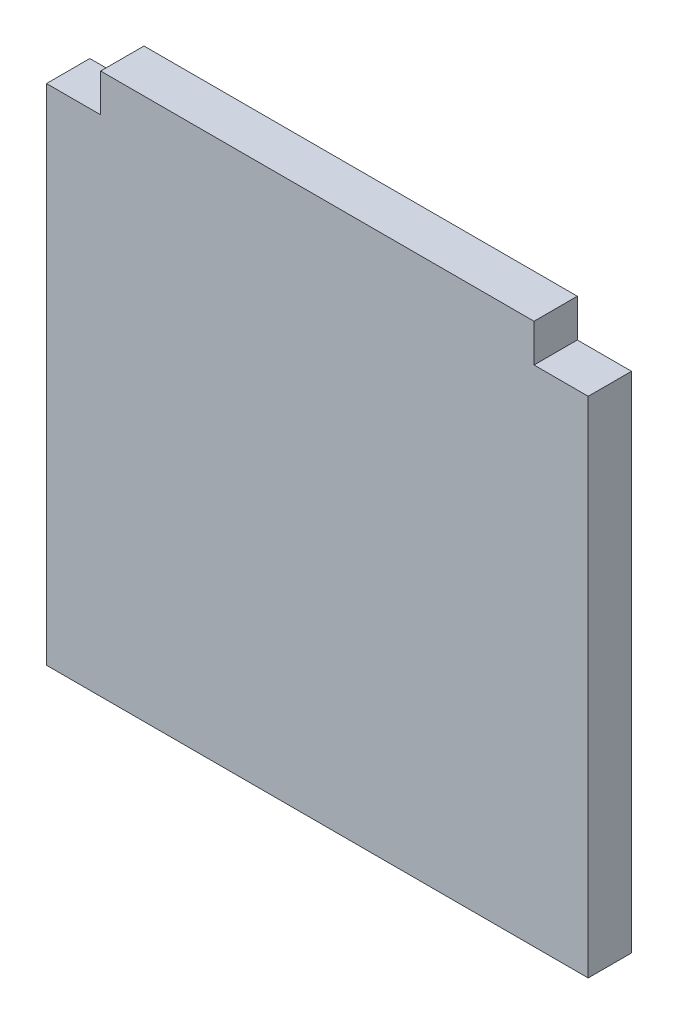
ISO-10303-21;
HEADER;
FILE_DESCRIPTION(('STEP AP214'),'2;1');
FILE_NAME('part.step','',(''),(''),'','','');
FILE_SCHEMA(('AUTOMOTIVE_DESIGN { 1 0 10303 214 1 1 1 1 }'));
ENDSEC;
DATA;
#1=APPLICATION_CONTEXT('core data for automotive mechanical design processes');
#2=APPLICATION_PROTOCOL_DEFINITION('international standard','automotive_design',2000,#1);
#3=PRODUCT_CONTEXT('',#1,'mechanical');
#4=PRODUCT('Part','Part','',(#3));
#5=PRODUCT_RELATED_PRODUCT_CATEGORY('part','',(#4));
#6=PRODUCT_DEFINITION_FORMATION('','',#4);
#7=PRODUCT_DEFINITION_CONTEXT('part definition',#1,'design');
#8=PRODUCT_DEFINITION('design','',#6,#7);
#9=PRODUCT_DEFINITION_SHAPE('','',#8);
#10=(LENGTH_UNIT() NAMED_UNIT(*) SI_UNIT(.MILLI.,.METRE.));
#11=(NAMED_UNIT(*) PLANE_ANGLE_UNIT() SI_UNIT($,.RADIAN.));
#12=(NAMED_UNIT(*) SI_UNIT($,.STERADIAN.) SOLID_ANGLE_UNIT());
#13=UNCERTAINTY_MEASURE_WITH_UNIT(LENGTH_MEASURE(1.E-05),#10,'distance_accuracy_value','');
#14=(GEOMETRIC_REPRESENTATION_CONTEXT(3) GLOBAL_UNCERTAINTY_ASSIGNED_CONTEXT((#13)) GLOBAL_UNIT_ASSIGNED_CONTEXT((#10,
#11,#12)) REPRESENTATION_CONTEXT('',''));
#15=CARTESIAN_POINT('',(0.,0.,0.));
#16=DIRECTION('',(0.,0.,1.));
#17=DIRECTION('',(1.,0.,0.));
#18=AXIS2_PLACEMENT_3D('',#15,#16,#17);
#19=CARTESIAN_POINT('',(0.4,0.,0.));
#20=DIRECTION('',(-1.,0.,0.));
#21=DIRECTION('',(0.,-1.,0.));
#22=AXIS2_PLACEMENT_3D('',#19,#20,#21);
#23=PLANE('',#22);
#24=DIRECTION('',(0.,-1.,0.));
#25=VECTOR('',#24,1.);
#26=CARTESIAN_POINT('',(0.4,0.,0.08));
#27=LINE('',#26,#25);
#28=CARTESIAN_POINT('',(0.4,-0.866025403784439,0.08));
#29=VERTEX_POINT('',#28);
#30=CARTESIAN_POINT('',(0.4,-0.936025403784438,0.08));
#31=VERTEX_POINT('',#30);
#32=EDGE_CURVE('E132',#29,#31,#27,.T.);
#33=ORIENTED_EDGE('',*,*,#32,.T.);
#34=DIRECTION('',(0.,0.,1.));
#35=VECTOR('',#34,1.);
#36=CARTESIAN_POINT('',(0.4,-0.936025403784438,0.));
#37=LINE('',#36,#35);
#38=CARTESIAN_POINT('',(0.4,-0.936025403784438,0.));
#39=VERTEX_POINT('',#38);
#40=EDGE_CURVE('E11',#39,#31,#37,.T.);
#41=ORIENTED_EDGE('',*,*,#40,.F.);
#42=DIRECTION('',(0.,-1.,0.));
#43=VECTOR('',#42,1.);
#44=CARTESIAN_POINT('',(0.4,0.,0.));
#45=LINE('',#44,#43);
#46=CARTESIAN_POINT('',(0.4,-0.866025403784439,0.));
#47=VERTEX_POINT('',#46);
#48=EDGE_CURVE('E53',#47,#39,#45,.T.);
#49=ORIENTED_EDGE('',*,*,#48,.F.);
#50=DIRECTION('',(0.,0.,1.));
#51=VECTOR('',#50,1.);
#52=CARTESIAN_POINT('',(0.4,-0.866025403784439,0.));
#53=LINE('',#52,#51);
#54=EDGE_CURVE('E38',#47,#29,#53,.T.);
#55=ORIENTED_EDGE('',*,*,#54,.T.);
#56=EDGE_LOOP('',(#33,#41,#49,#55));
#57=FACE_BOUND('',#56,.T.);
#58=ADVANCED_FACE('F35',(#57),#23,.F.);
#59=CARTESIAN_POINT('',(0.,-0.936025403784438,0.));
#60=DIRECTION('',(0.,1.,0.));
#61=DIRECTION('',(-1.,0.,0.));
#62=AXIS2_PLACEMENT_3D('',#59,#60,#61);
#63=PLANE('',#62);
#64=DIRECTION('',(-1.,0.,0.));
#65=VECTOR('',#64,1.);
#66=CARTESIAN_POINT('',(0.,-0.936025403784438,0.08));
#67=LINE('',#66,#65);
#68=CARTESIAN_POINT('',(0.5,-0.936025403784438,0.08));
#69=VERTEX_POINT('',#68);
#70=EDGE_CURVE('E148',#69,#31,#67,.T.);
#71=ORIENTED_EDGE('',*,*,#70,.F.);
#72=DIRECTION('',(0.,0.,1.));
#73=VECTOR('',#72,1.);
#74=CARTESIAN_POINT('',(0.5,-0.936025403784438,0.));
#75=LINE('',#74,#73);
#76=CARTESIAN_POINT('',(0.5,-0.936025403784438,0.));
#77=VERTEX_POINT('',#76);
#78=EDGE_CURVE('E44',#77,#69,#75,.T.);
#79=ORIENTED_EDGE('',*,*,#78,.F.);
#80=DIRECTION('',(-1.,0.,0.));
#81=VECTOR('',#80,1.);
#82=CARTESIAN_POINT('',(0.,-0.936025403784438,0.));
#83=LINE('',#82,#81);
#84=EDGE_CURVE('E112',#77,#39,#83,.T.);
#85=ORIENTED_EDGE('',*,*,#84,.T.);
#86=ORIENTED_EDGE('',*,*,#40,.T.);
#87=EDGE_LOOP('',(#71,#79,#85,#86));
#88=FACE_BOUND('',#87,.T.);
#89=ADVANCED_FACE('F165',(#88),#63,.T.);
#90=CARTESIAN_POINT('',(0.5,0.,0.));
#91=DIRECTION('',(-1.,0.,0.));
#92=DIRECTION('',(0.,-1.,0.));
#93=AXIS2_PLACEMENT_3D('',#90,#91,#92);
#94=PLANE('',#93);
#95=DIRECTION('',(0.,-1.,0.));
#96=VECTOR('',#95,1.);
#97=CARTESIAN_POINT('',(0.5,0.,0.08));
#98=LINE('',#97,#96);
#99=CARTESIAN_POINT('',(0.500000000000001,-1.86602540378444,0.08));
#100=VERTEX_POINT('',#99);
#101=EDGE_CURVE('E117',#69,#100,#98,.T.);
#102=ORIENTED_EDGE('',*,*,#101,.T.);
#103=DIRECTION('',(0.,0.,1.));
#104=VECTOR('',#103,1.);
#105=CARTESIAN_POINT('',(0.500000000000001,-1.86602540378444,0.));
#106=LINE('',#105,#104);
#107=CARTESIAN_POINT('',(0.500000000000001,-1.86602540378444,0.));
#108=VERTEX_POINT('',#107);
#109=EDGE_CURVE('E115',#108,#100,#106,.T.);
#110=ORIENTED_EDGE('',*,*,#109,.F.);
#111=DIRECTION('',(0.,-1.,0.));
#112=VECTOR('',#111,1.);
#113=CARTESIAN_POINT('',(0.5,0.,0.));
#114=LINE('',#113,#112);
#115=EDGE_CURVE('E105',#77,#108,#114,.T.);
#116=ORIENTED_EDGE('',*,*,#115,.F.);
#117=ORIENTED_EDGE('',*,*,#78,.T.);
#118=EDGE_LOOP('',(#102,#110,#116,#117));
#119=FACE_BOUND('',#118,.T.);
#120=ADVANCED_FACE('F116',(#119),#94,.F.);
#121=CARTESIAN_POINT('',(0.,-1.86602540378444,0.));
#122=DIRECTION('',(0.,1.,0.));
#123=DIRECTION('',(-1.,0.,0.));
#124=AXIS2_PLACEMENT_3D('',#121,#122,#123);
#125=PLANE('',#124);
#126=DIRECTION('',(-1.,0.,0.));
#127=VECTOR('',#126,1.);
#128=CARTESIAN_POINT('',(0.,-1.86602540378444,0.08));
#129=LINE('',#128,#127);
#130=CARTESIAN_POINT('',(-0.499999999999998,-1.86602540378444,0.08));
#131=VERTEX_POINT('',#130);
#132=EDGE_CURVE('E145',#100,#131,#129,.T.);
#133=ORIENTED_EDGE('',*,*,#132,.T.);
#134=DIRECTION('',(0.,0.,1.));
#135=VECTOR('',#134,1.);
#136=CARTESIAN_POINT('',(-0.499999999999998,-1.86602540378444,0.));
#137=LINE('',#136,#135);
#138=CARTESIAN_POINT('',(-0.499999999999998,-1.86602540378444,0.));
#139=VERTEX_POINT('',#138);
#140=EDGE_CURVE('E121',#139,#131,#137,.T.);
#141=ORIENTED_EDGE('',*,*,#140,.F.);
#142=DIRECTION('',(-1.,0.,0.));
#143=VECTOR('',#142,1.);
#144=CARTESIAN_POINT('',(0.,-1.86602540378444,0.));
#145=LINE('',#144,#143);
#146=EDGE_CURVE('E110',#108,#139,#145,.T.);
#147=ORIENTED_EDGE('',*,*,#146,.F.);
#148=ORIENTED_EDGE('',*,*,#109,.T.);
#149=EDGE_LOOP('',(#133,#141,#147,#148));
#150=FACE_BOUND('',#149,.T.);
#151=ADVANCED_FACE('F123',(#150),#125,.F.);
#152=CARTESIAN_POINT('',(-0.500000000000001,0.,0.));
#153=DIRECTION('',(-1.,0.,0.));
#154=DIRECTION('',(0.,-1.,0.));
#155=AXIS2_PLACEMENT_3D('',#152,#153,#154);
#156=PLANE('',#155);
#157=DIRECTION('',(0.,-1.,0.));
#158=VECTOR('',#157,1.);
#159=CARTESIAN_POINT('',(-0.500000000000001,0.,0.08));
#160=LINE('',#159,#158);
#161=CARTESIAN_POINT('',(-0.499999999999999,-0.936025403784439,0.08));
#162=VERTEX_POINT('',#161);
#163=EDGE_CURVE('E142',#162,#131,#160,.T.);
#164=ORIENTED_EDGE('',*,*,#163,.F.);
#165=DIRECTION('',(0.,0.,1.));
#166=VECTOR('',#165,1.);
#167=CARTESIAN_POINT('',(-0.499999999999999,-0.936025403784439,0.));
#168=LINE('',#167,#166);
#169=CARTESIAN_POINT('',(-0.499999999999999,-0.936025403784439,0.));
#170=VERTEX_POINT('',#169);
#171=EDGE_CURVE('E153',#170,#162,#168,.T.);
#172=ORIENTED_EDGE('',*,*,#171,.F.);
#173=DIRECTION('',(0.,-1.,0.));
#174=VECTOR('',#173,1.);
#175=CARTESIAN_POINT('',(-0.500000000000001,0.,0.));
#176=LINE('',#175,#174);
#177=EDGE_CURVE('E125',#170,#139,#176,.T.);
#178=ORIENTED_EDGE('',*,*,#177,.T.);
#179=ORIENTED_EDGE('',*,*,#140,.T.);
#180=EDGE_LOOP('',(#164,#172,#178,#179));
#181=FACE_BOUND('',#180,.T.);
#182=ADVANCED_FACE('F178',(#181),#156,.T.);
#183=CARTESIAN_POINT('',(0.,-0.936025403784438,0.));
#184=DIRECTION('',(0.,-1.,0.));
#185=DIRECTION('',(1.,0.,0.));
#186=AXIS2_PLACEMENT_3D('',#183,#184,#185);
#187=PLANE('',#186);
#188=DIRECTION('',(1.,0.,0.));
#189=VECTOR('',#188,1.);
#190=CARTESIAN_POINT('',(0.,-0.936025403784438,0.08));
#191=LINE('',#190,#189);
#192=CARTESIAN_POINT('',(-0.399999999999999,-0.936025403784439,0.08));
#193=VERTEX_POINT('',#192);
#194=EDGE_CURVE('E139',#162,#193,#191,.T.);
#195=ORIENTED_EDGE('',*,*,#194,.T.);
#196=DIRECTION('',(0.,0.,1.));
#197=VECTOR('',#196,1.);
#198=CARTESIAN_POINT('',(-0.399999999999999,-0.936025403784439,0.));
#199=LINE('',#198,#197);
#200=CARTESIAN_POINT('',(-0.399999999999999,-0.936025403784439,0.));
#201=VERTEX_POINT('',#200);
#202=EDGE_CURVE('E155',#201,#193,#199,.T.);
#203=ORIENTED_EDGE('',*,*,#202,.F.);
#204=DIRECTION('',(1.,0.,0.));
#205=VECTOR('',#204,1.);
#206=CARTESIAN_POINT('',(0.,-0.936025403784438,0.));
#207=LINE('',#206,#205);
#208=EDGE_CURVE('E127',#170,#201,#207,.T.);
#209=ORIENTED_EDGE('',*,*,#208,.F.);
#210=ORIENTED_EDGE('',*,*,#171,.T.);
#211=EDGE_LOOP('',(#195,#203,#209,#210));
#212=FACE_BOUND('',#211,.T.);
#213=ADVANCED_FACE('F181',(#212),#187,.F.);
#214=CARTESIAN_POINT('',(-0.399999999999999,0.,0.));
#215=DIRECTION('',(-1.,0.,0.));
#216=DIRECTION('',(0.,0.,1.));
#217=AXIS2_PLACEMENT_3D('',#214,#215,#216);
#218=PLANE('',#217);
#219=DIRECTION('',(0.,-1.,0.));
#220=VECTOR('',#219,1.);
#221=CARTESIAN_POINT('',(-0.399999999999999,0.,0.08));
#222=LINE('',#221,#220);
#223=CARTESIAN_POINT('',(-0.399999999999999,-0.866025403784439,0.08));
#224=VERTEX_POINT('',#223);
#225=EDGE_CURVE('E136',#224,#193,#222,.T.);
#226=ORIENTED_EDGE('',*,*,#225,.F.);
#227=DIRECTION('',(0.,0.,1.));
#228=VECTOR('',#227,1.);
#229=CARTESIAN_POINT('',(-0.399999999999999,-0.866025403784439,0.));
#230=LINE('',#229,#228);
#231=CARTESIAN_POINT('',(-0.399999999999999,-0.866025403784439,0.));
#232=VERTEX_POINT('',#231);
#233=EDGE_CURVE('E156',#232,#224,#230,.T.);
#234=ORIENTED_EDGE('',*,*,#233,.F.);
#235=DIRECTION('',(0.,-1.,0.));
#236=VECTOR('',#235,1.);
#237=CARTESIAN_POINT('',(-0.399999999999999,0.,0.));
#238=LINE('',#237,#236);
#239=EDGE_CURVE('E259',#232,#201,#238,.T.);
#240=ORIENTED_EDGE('',*,*,#239,.T.);
#241=ORIENTED_EDGE('',*,*,#202,.T.);
#242=EDGE_LOOP('',(#226,#234,#240,#241));
#243=FACE_BOUND('',#242,.T.);
#244=ADVANCED_FACE('F185',(#243),#218,.T.);
#245=CARTESIAN_POINT('',(0.,-0.866025403784439,0.));
#246=DIRECTION('',(0.,-1.,0.));
#247=DIRECTION('',(1.,0.,0.));
#248=AXIS2_PLACEMENT_3D('',#245,#246,#247);
#249=PLANE('',#248);
#250=DIRECTION('',(1.,0.,0.));
#251=VECTOR('',#250,1.);
#252=CARTESIAN_POINT('',(0.,-0.866025403784439,0.08));
#253=LINE('',#252,#251);
#254=EDGE_CURVE('E134',#224,#29,#253,.T.);
#255=ORIENTED_EDGE('',*,*,#254,.T.);
#256=ORIENTED_EDGE('',*,*,#54,.F.);
#257=DIRECTION('',(1.,0.,0.));
#258=VECTOR('',#257,1.);
#259=CARTESIAN_POINT('',(0.,-0.866025403784439,0.));
#260=LINE('',#259,#258);
#261=EDGE_CURVE('E91',#232,#47,#260,.T.);
#262=ORIENTED_EDGE('',*,*,#261,.F.);
#263=ORIENTED_EDGE('',*,*,#233,.T.);
#264=EDGE_LOOP('',(#255,#256,#262,#263));
#265=FACE_BOUND('',#264,.T.);
#266=ADVANCED_FACE('F188',(#265),#249,.F.);
#267=CARTESIAN_POINT('',(0.,0.,0.));
#268=DIRECTION('',(0.,0.,1.));
#269=DIRECTION('',(1.,0.,0.));
#270=AXIS2_PLACEMENT_3D('',#267,#268,#269);
#271=PLANE('',#270);
#272=ORIENTED_EDGE('',*,*,#48,.T.);
#273=ORIENTED_EDGE('',*,*,#84,.F.);
#274=ORIENTED_EDGE('',*,*,#115,.T.);
#275=ORIENTED_EDGE('',*,*,#146,.T.);
#276=ORIENTED_EDGE('',*,*,#177,.F.);
#277=ORIENTED_EDGE('',*,*,#208,.T.);
#278=ORIENTED_EDGE('',*,*,#239,.F.);
#279=ORIENTED_EDGE('',*,*,#261,.T.);
#280=EDGE_LOOP('',(#272,#273,#274,#275,#276,#277,#278,#279));
#281=FACE_BOUND('',#280,.T.);
#282=ADVANCED_FACE('F107',(#281),#271,.F.);
#283=CARTESIAN_POINT('',(0.,0.,0.08));
#284=DIRECTION('',(0.,0.,1.));
#285=DIRECTION('',(1.,0.,0.));
#286=AXIS2_PLACEMENT_3D('',#283,#284,#285);
#287=PLANE('',#286);
#288=ORIENTED_EDGE('',*,*,#32,.F.);
#289=ORIENTED_EDGE('',*,*,#254,.F.);
#290=ORIENTED_EDGE('',*,*,#225,.T.);
#291=ORIENTED_EDGE('',*,*,#194,.F.);
#292=ORIENTED_EDGE('',*,*,#163,.T.);
#293=ORIENTED_EDGE('',*,*,#132,.F.);
#294=ORIENTED_EDGE('',*,*,#101,.F.);
#295=ORIENTED_EDGE('',*,*,#70,.T.);
#296=EDGE_LOOP('',(#288,#289,#290,#291,#292,#293,#294,#295));
#297=FACE_BOUND('',#296,.T.);
#298=ADVANCED_FACE('F163',(#297),#287,.T.);
#299=CLOSED_SHELL('',(#58,#89,#120,#151,#182,#213,#244,#266,#282,#298));
#300=MANIFOLD_SOLID_BREP('B2',#299);
#301=ADVANCED_BREP_SHAPE_REPRESENTATION('',(#18,#300),#14);
#302=SHAPE_DEFINITION_REPRESENTATION(#9,#301);
ENDSEC;
END-ISO-10303-21;
